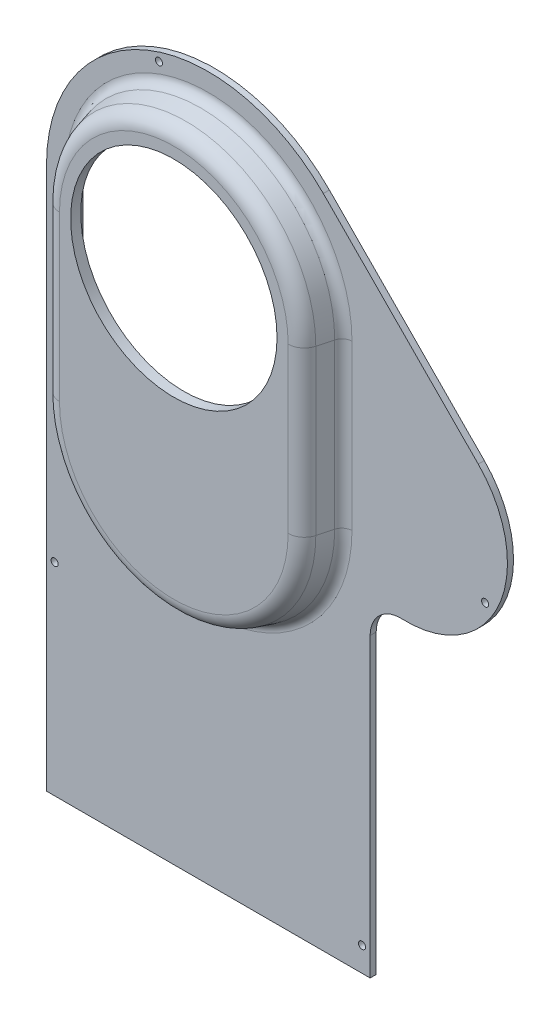
ISO-10303-21;
HEADER;
FILE_DESCRIPTION(('STEP AP214'),'2;1');
FILE_NAME('part.step','',(''),(''),'','','');
FILE_SCHEMA(('AUTOMOTIVE_DESIGN { 1 0 10303 214 1 1 1 1 }'));
ENDSEC;
DATA;
#1=APPLICATION_CONTEXT('core data for automotive mechanical design processes');
#2=APPLICATION_PROTOCOL_DEFINITION('international standard','automotive_design',2000,#1);
#3=PRODUCT_CONTEXT('',#1,'mechanical');
#4=PRODUCT('Part','Part','',(#3));
#5=PRODUCT_RELATED_PRODUCT_CATEGORY('part','',(#4));
#6=PRODUCT_DEFINITION_FORMATION('','',#4);
#7=PRODUCT_DEFINITION_CONTEXT('part definition',#1,'design');
#8=PRODUCT_DEFINITION('design','',#6,#7);
#9=PRODUCT_DEFINITION_SHAPE('','',#8);
#10=(LENGTH_UNIT() NAMED_UNIT(*) SI_UNIT(.MILLI.,.METRE.));
#11=(NAMED_UNIT(*) PLANE_ANGLE_UNIT() SI_UNIT($,.RADIAN.));
#12=(NAMED_UNIT(*) SI_UNIT($,.STERADIAN.) SOLID_ANGLE_UNIT());
#13=UNCERTAINTY_MEASURE_WITH_UNIT(LENGTH_MEASURE(1.E-05),#10,'distance_accuracy_value','');
#14=(GEOMETRIC_REPRESENTATION_CONTEXT(3) GLOBAL_UNCERTAINTY_ASSIGNED_CONTEXT((#13)) GLOBAL_UNIT_ASSIGNED_CONTEXT((#10,
#11,#12)) REPRESENTATION_CONTEXT('',''));
#15=CARTESIAN_POINT('',(0.,0.,0.));
#16=DIRECTION('',(0.,0.,1.));
#17=DIRECTION('',(1.,0.,0.));
#18=AXIS2_PLACEMENT_3D('',#15,#16,#17);
#19=CARTESIAN_POINT('',(10.6567303435174,21.0340968700912,0.));
#20=DIRECTION('',(0.,0.,1.));
#21=DIRECTION('',(1.,0.,0.));
#22=AXIS2_PLACEMENT_3D('',#19,#20,#21);
#23=PLANE('',#22);
#24=CARTESIAN_POINT('',(86.6567303435173,-234.965903129909,0.));
#25=DIRECTION('',(0.,0.,1.));
#26=DIRECTION('',(1.,0.,0.));
#27=AXIS2_PLACEMENT_3D('',#24,#25,#26);
#28=CIRCLE('',#27,1.75);
#29=CARTESIAN_POINT('',(88.4067303435173,-234.965903129909,0.));
#30=VERTEX_POINT('',#29);
#31=EDGE_CURVE('E860',#30,#30,#28,.T.);
#32=ORIENTED_EDGE('',*,*,#31,.T.);
#33=EDGE_LOOP('',(#32));
#34=FACE_BOUND('',#33,.T.);
#35=CARTESIAN_POINT('',(-65.2642696564826,-146.965903129909,0.));
#36=DIRECTION('',(0.,0.,1.));
#37=DIRECTION('',(1.,0.,0.));
#38=AXIS2_PLACEMENT_3D('',#35,#36,#37);
#39=CIRCLE('',#38,1.75);
#40=CARTESIAN_POINT('',(-63.5142696564826,-146.965903129909,0.));
#41=VERTEX_POINT('',#40);
#42=EDGE_CURVE('E854',#41,#41,#39,.T.);
#43=ORIENTED_EDGE('',*,*,#42,.T.);
#44=EDGE_LOOP('',(#43));
#45=FACE_BOUND('',#44,.T.);
#46=CARTESIAN_POINT('',(147.488744141459,-57.965903129909,0.));
#47=DIRECTION('',(0.,0.,1.));
#48=DIRECTION('',(1.,0.,0.));
#49=AXIS2_PLACEMENT_3D('',#46,#47,#48);
#50=CIRCLE('',#49,1.75000000000001);
#51=CARTESIAN_POINT('',(149.238744141459,-57.965903129909,0.));
#52=VERTEX_POINT('',#51);
#53=EDGE_CURVE('E849',#52,#52,#50,.T.);
#54=ORIENTED_EDGE('',*,*,#53,.T.);
#55=EDGE_LOOP('',(#54));
#56=FACE_BOUND('',#55,.T.);
#57=CARTESIAN_POINT('',(-13.6743197776755,93.0340968700912,0.));
#58=DIRECTION('',(0.,0.,1.));
#59=DIRECTION('',(1.,0.,0.));
#60=AXIS2_PLACEMENT_3D('',#57,#58,#59);
#61=CIRCLE('',#60,1.75);
#62=CARTESIAN_POINT('',(-11.9243197776755,93.0340968700912,0.));
#63=VERTEX_POINT('',#62);
#64=EDGE_CURVE('E842',#63,#63,#61,.T.);
#65=ORIENTED_EDGE('',*,*,#64,.T.);
#66=EDGE_LOOP('',(#65));
#67=FACE_BOUND('',#66,.T.);
#68=CARTESIAN_POINT('',(10.6567303435174,21.0340968700912,0.));
#69=DIRECTION('',(0.,0.,1.));
#70=DIRECTION('',(1.,0.,0.));
#71=AXIS2_PLACEMENT_3D('',#68,#69,#70);
#72=CIRCLE('',#71,79.921);
#73=CARTESIAN_POINT('',(67.51781858102,77.1962094144654,0.));
#74=VERTEX_POINT('',#73);
#75=CARTESIAN_POINT('',(-69.2642696564826,21.0340968700912,0.));
#76=VERTEX_POINT('',#75);
#77=EDGE_CURVE('E275',#74,#76,#72,.T.);
#78=ORIENTED_EDGE('',*,*,#77,.F.);
#79=DIRECTION('',(-0.702720343143531,0.711466175817402,0.));
#80=VECTOR('',#79,1.);
#81=CARTESIAN_POINT('',(144.090909762029,-0.329885972732348,0.));
#82=LINE('',#81,#80);
#83=CARTESIAN_POINT('',(144.090909762029,-0.329885972732348,0.));
#84=VERTEX_POINT('',#83);
#85=EDGE_CURVE('E289',#84,#74,#82,.T.);
#86=ORIENTED_EDGE('',*,*,#85,.F.);
#87=CARTESIAN_POINT('',(108.517600971159,-35.4659031299089,0.));
#88=DIRECTION('',(0.,0.,1.));
#89=DIRECTION('',(1.,0.,0.));
#90=AXIS2_PLACEMENT_3D('',#87,#88,#89);
#91=CIRCLE('',#90,50.);
#92=CARTESIAN_POINT('',(106.316931257588,-85.4174501811442,0.));
#93=VERTEX_POINT('',#92);
#94=EDGE_CURVE('E287',#93,#84,#91,.T.);
#95=ORIENTED_EDGE('',*,*,#94,.F.);
#96=CARTESIAN_POINT('',(105.656730343517,-100.402914296515,0.));
#97=DIRECTION('',(0.,0.,-1.));
#98=DIRECTION('',(1.,0.,0.));
#99=AXIS2_PLACEMENT_3D('',#96,#97,#98);
#100=CIRCLE('',#99,15.);
#101=CARTESIAN_POINT('',(90.6567303435173,-100.402914296515,0.));
#102=VERTEX_POINT('',#101);
#103=EDGE_CURVE('E285',#102,#93,#100,.T.);
#104=ORIENTED_EDGE('',*,*,#103,.F.);
#105=DIRECTION('',(0.,1.,0.));
#106=VECTOR('',#105,1.);
#107=CARTESIAN_POINT('',(90.6567303435173,-246.965903129909,0.));
#108=LINE('',#107,#106);
#109=CARTESIAN_POINT('',(90.6567303435173,-246.965903129909,0.));
#110=VERTEX_POINT('',#109);
#111=EDGE_CURVE('E283',#110,#102,#108,.T.);
#112=ORIENTED_EDGE('',*,*,#111,.F.);
#113=DIRECTION('',(1.,0.,0.));
#114=VECTOR('',#113,1.);
#115=CARTESIAN_POINT('',(-69.2642696564826,-246.965903129909,0.));
#116=LINE('',#115,#114);
#117=CARTESIAN_POINT('',(-69.2642696564826,-246.965903129909,0.));
#118=VERTEX_POINT('',#117);
#119=EDGE_CURVE('E281',#118,#110,#116,.T.);
#120=ORIENTED_EDGE('',*,*,#119,.F.);
#121=DIRECTION('',(0.,-1.,0.));
#122=VECTOR('',#121,1.);
#123=CARTESIAN_POINT('',(-69.2642696564826,21.0340968700912,0.));
#124=LINE('',#123,#122);
#125=EDGE_CURVE('E278',#76,#118,#124,.T.);
#126=ORIENTED_EDGE('',*,*,#125,.F.);
#127=EDGE_LOOP('',(#78,#86,#95,#104,#112,#120,#126));
#128=FACE_BOUND('',#127,.T.);
#129=DIRECTION('',(0.,1.,0.));
#130=VECTOR('',#129,1.);
#131=CARTESIAN_POINT('',(-54.3760570190842,21.0340968700912,0.));
#132=LINE('',#131,#130);
#133=CARTESIAN_POINT('',(-54.3760570190842,-59.9659031299088,0.));
#134=VERTEX_POINT('',#133);
#135=CARTESIAN_POINT('',(-54.3760570190842,21.0340968700912,0.));
#136=VERTEX_POINT('',#135);
#137=EDGE_CURVE('E271',#134,#136,#132,.T.);
#138=ORIENTED_EDGE('',*,*,#137,.F.);
#139=CARTESIAN_POINT('',(10.6567303435173,-59.9659031299088,0.));
#140=DIRECTION('',(0.,0.,-1.));
#141=DIRECTION('',(-1.,0.,0.));
#142=AXIS2_PLACEMENT_3D('',#139,#140,#141);
#143=CIRCLE('',#142,65.0327873626014);
#144=CARTESIAN_POINT('',(75.6895177061187,-59.9659031299088,0.));
#145=VERTEX_POINT('',#144);
#146=EDGE_CURVE('E269',#145,#134,#143,.T.);
#147=ORIENTED_EDGE('',*,*,#146,.F.);
#148=DIRECTION('',(0.,-1.,0.));
#149=VECTOR('',#148,1.);
#150=CARTESIAN_POINT('',(75.6895177061187,21.0340968700912,0.));
#151=LINE('',#150,#149);
#152=CARTESIAN_POINT('',(75.6895177061187,21.0340968700912,0.));
#153=VERTEX_POINT('',#152);
#154=EDGE_CURVE('E247',#153,#145,#151,.T.);
#155=ORIENTED_EDGE('',*,*,#154,.F.);
#156=CARTESIAN_POINT('',(10.6567303435173,21.0340968700912,0.));
#157=DIRECTION('',(0.,0.,-1.));
#158=DIRECTION('',(-1.,0.,0.));
#159=AXIS2_PLACEMENT_3D('',#156,#157,#158);
#160=CIRCLE('',#159,65.0327873626014);
#161=EDGE_CURVE('E198',#136,#153,#160,.T.);
#162=ORIENTED_EDGE('',*,*,#161,.F.);
#163=EDGE_LOOP('',(#138,#147,#155,#162));
#164=FACE_BOUND('',#163,.T.);
#165=ADVANCED_FACE('F34',(#34,#45,#56,#67,#128,#164),#23,.F.);
#166=CARTESIAN_POINT('',(10.6567303435174,21.0340968700912,3.));
#167=DIRECTION('',(0.,0.,1.));
#168=DIRECTION('',(1.,0.,0.));
#169=AXIS2_PLACEMENT_3D('',#166,#167,#168);
#170=PLANE('',#169);
#171=CARTESIAN_POINT('',(86.6567303435173,-234.965903129909,3.));
#172=DIRECTION('',(0.,0.,1.));
#173=DIRECTION('',(1.,0.,0.));
#174=AXIS2_PLACEMENT_3D('',#171,#172,#173);
#175=CIRCLE('',#174,1.75);
#176=CARTESIAN_POINT('',(88.4067303435173,-234.965903129909,3.));
#177=VERTEX_POINT('',#176);
#178=EDGE_CURVE('E863',#177,#177,#175,.T.);
#179=ORIENTED_EDGE('',*,*,#178,.F.);
#180=EDGE_LOOP('',(#179));
#181=FACE_BOUND('',#180,.T.);
#182=CARTESIAN_POINT('',(-65.2642696564826,-146.965903129909,3.));
#183=DIRECTION('',(0.,0.,1.));
#184=DIRECTION('',(1.,0.,0.));
#185=AXIS2_PLACEMENT_3D('',#182,#183,#184);
#186=CIRCLE('',#185,1.75);
#187=CARTESIAN_POINT('',(-63.5142696564826,-146.965903129909,3.));
#188=VERTEX_POINT('',#187);
#189=EDGE_CURVE('E857',#188,#188,#186,.T.);
#190=ORIENTED_EDGE('',*,*,#189,.F.);
#191=EDGE_LOOP('',(#190));
#192=FACE_BOUND('',#191,.T.);
#193=CARTESIAN_POINT('',(147.488744141459,-57.965903129909,3.));
#194=DIRECTION('',(0.,0.,1.));
#195=DIRECTION('',(1.,0.,0.));
#196=AXIS2_PLACEMENT_3D('',#193,#194,#195);
#197=CIRCLE('',#196,1.75000000000001);
#198=CARTESIAN_POINT('',(149.238744141459,-57.965903129909,3.));
#199=VERTEX_POINT('',#198);
#200=EDGE_CURVE('E851',#199,#199,#197,.T.);
#201=ORIENTED_EDGE('',*,*,#200,.F.);
#202=EDGE_LOOP('',(#201));
#203=FACE_BOUND('',#202,.T.);
#204=CARTESIAN_POINT('',(-13.6743197776755,93.0340968700912,3.));
#205=DIRECTION('',(0.,0.,1.));
#206=DIRECTION('',(1.,0.,0.));
#207=AXIS2_PLACEMENT_3D('',#204,#205,#206);
#208=CIRCLE('',#207,1.75);
#209=CARTESIAN_POINT('',(-11.9243197776755,93.0340968700912,3.));
#210=VERTEX_POINT('',#209);
#211=EDGE_CURVE('E845',#210,#210,#208,.T.);
#212=ORIENTED_EDGE('',*,*,#211,.F.);
#213=EDGE_LOOP('',(#212));
#214=FACE_BOUND('',#213,.T.);
#215=DIRECTION('',(0.,-1.,0.));
#216=VECTOR('',#215,1.);
#217=CARTESIAN_POINT('',(81.6895177061187,21.0340968700912,3.));
#218=LINE('',#217,#216);
#219=CARTESIAN_POINT('',(81.6895177061187,21.0340968700912,3.));
#220=VERTEX_POINT('',#219);
#221=CARTESIAN_POINT('',(81.6895177061187,-59.9659031299088,3.));
#222=VERTEX_POINT('',#221);
#223=EDGE_CURVE('E342',#220,#222,#218,.T.);
#224=ORIENTED_EDGE('',*,*,#223,.T.);
#225=CARTESIAN_POINT('',(10.6567303435173,-59.9659031299088,3.));
#226=DIRECTION('',(0.,0.,1.));
#227=DIRECTION('',(1.,0.,0.));
#228=AXIS2_PLACEMENT_3D('',#225,#226,#227);
#229=CIRCLE('',#228,71.0327873626015);
#230=CARTESIAN_POINT('',(-60.3760570190841,-59.9659031299088,3.));
#231=VERTEX_POINT('',#230);
#232=EDGE_CURVE('E344',#222,#231,#229,.F.);
#233=ORIENTED_EDGE('',*,*,#232,.T.);
#234=DIRECTION('',(0.,1.,0.));
#235=VECTOR('',#234,1.);
#236=CARTESIAN_POINT('',(-60.3760570190842,21.0340968700912,3.));
#237=LINE('',#236,#235);
#238=CARTESIAN_POINT('',(-60.3760570190842,21.0340968700912,3.));
#239=VERTEX_POINT('',#238);
#240=EDGE_CURVE('E340',#231,#239,#237,.T.);
#241=ORIENTED_EDGE('',*,*,#240,.T.);
#242=CARTESIAN_POINT('',(10.6567303435173,21.0340968700912,3.));
#243=DIRECTION('',(0.,0.,1.));
#244=DIRECTION('',(1.,0.,0.));
#245=AXIS2_PLACEMENT_3D('',#242,#243,#244);
#246=CIRCLE('',#245,71.0327873626014);
#247=EDGE_CURVE('E338',#239,#220,#246,.F.);
#248=ORIENTED_EDGE('',*,*,#247,.T.);
#249=EDGE_LOOP('',(#224,#233,#241,#248));
#250=FACE_BOUND('',#249,.T.);
#251=CARTESIAN_POINT('',(10.6567303435174,21.0340968700912,3.));
#252=DIRECTION('',(0.,0.,1.));
#253=DIRECTION('',(1.,0.,0.));
#254=AXIS2_PLACEMENT_3D('',#251,#252,#253);
#255=CIRCLE('',#254,79.921);
#256=CARTESIAN_POINT('',(67.51781858102,77.1962094144654,3.));
#257=VERTEX_POINT('',#256);
#258=CARTESIAN_POINT('',(-69.2642696564826,21.0340968700912,3.));
#259=VERTEX_POINT('',#258);
#260=EDGE_CURVE('E291',#257,#259,#255,.T.);
#261=ORIENTED_EDGE('',*,*,#260,.T.);
#262=DIRECTION('',(0.,-1.,0.));
#263=VECTOR('',#262,1.);
#264=CARTESIAN_POINT('',(-69.2642696564826,21.0340968700912,3.));
#265=LINE('',#264,#263);
#266=CARTESIAN_POINT('',(-69.2642696564826,-246.965903129909,3.));
#267=VERTEX_POINT('',#266);
#268=EDGE_CURVE('E294',#259,#267,#265,.T.);
#269=ORIENTED_EDGE('',*,*,#268,.T.);
#270=DIRECTION('',(1.,0.,0.));
#271=VECTOR('',#270,1.);
#272=CARTESIAN_POINT('',(-69.2642696564826,-246.965903129909,3.));
#273=LINE('',#272,#271);
#274=CARTESIAN_POINT('',(90.6567303435173,-246.965903129909,3.));
#275=VERTEX_POINT('',#274);
#276=EDGE_CURVE('E296',#267,#275,#273,.T.);
#277=ORIENTED_EDGE('',*,*,#276,.T.);
#278=DIRECTION('',(0.,1.,0.));
#279=VECTOR('',#278,1.);
#280=CARTESIAN_POINT('',(90.6567303435173,-246.965903129909,3.));
#281=LINE('',#280,#279);
#282=CARTESIAN_POINT('',(90.6567303435173,-100.402914296515,3.));
#283=VERTEX_POINT('',#282);
#284=EDGE_CURVE('E298',#275,#283,#281,.T.);
#285=ORIENTED_EDGE('',*,*,#284,.T.);
#286=CARTESIAN_POINT('',(105.656730343517,-100.402914296515,3.));
#287=DIRECTION('',(0.,0.,-1.));
#288=DIRECTION('',(1.,0.,0.));
#289=AXIS2_PLACEMENT_3D('',#286,#287,#288);
#290=CIRCLE('',#289,15.);
#291=CARTESIAN_POINT('',(106.316931257588,-85.4174501811442,3.));
#292=VERTEX_POINT('',#291);
#293=EDGE_CURVE('E300',#283,#292,#290,.T.);
#294=ORIENTED_EDGE('',*,*,#293,.T.);
#295=CARTESIAN_POINT('',(108.517600971159,-35.4659031299089,3.));
#296=DIRECTION('',(0.,0.,1.));
#297=DIRECTION('',(1.,0.,0.));
#298=AXIS2_PLACEMENT_3D('',#295,#296,#297);
#299=CIRCLE('',#298,50.);
#300=CARTESIAN_POINT('',(144.090909762029,-0.329885972732348,3.));
#301=VERTEX_POINT('',#300);
#302=EDGE_CURVE('E302',#292,#301,#299,.T.);
#303=ORIENTED_EDGE('',*,*,#302,.T.);
#304=DIRECTION('',(-0.702720343143531,0.711466175817402,0.));
#305=VECTOR('',#304,1.);
#306=CARTESIAN_POINT('',(144.090909762029,-0.329885972732348,3.));
#307=LINE('',#306,#305);
#308=EDGE_CURVE('E304',#301,#257,#307,.T.);
#309=ORIENTED_EDGE('',*,*,#308,.T.);
#310=EDGE_LOOP('',(#261,#269,#277,#285,#294,#303,#309));
#311=FACE_BOUND('',#310,.T.);
#312=ADVANCED_FACE('F447',(#181,#192,#203,#214,#250,#311),#170,.T.);
#313=CARTESIAN_POINT('',(10.6567303435174,21.0340968700912,3.));
#314=DIRECTION('',(0.,0.,-1.));
#315=DIRECTION('',(-1.,0.,0.));
#316=AXIS2_PLACEMENT_3D('',#313,#314,#315);
#317=CYLINDRICAL_SURFACE('',#316,79.921);
#318=ORIENTED_EDGE('',*,*,#77,.T.);
#319=DIRECTION('',(0.,0.,-1.));
#320=VECTOR('',#319,1.);
#321=CARTESIAN_POINT('',(-69.2642696564826,21.0340968700912,3.));
#322=LINE('',#321,#320);
#323=EDGE_CURVE('E324',#259,#76,#322,.T.);
#324=ORIENTED_EDGE('',*,*,#323,.F.);
#325=ORIENTED_EDGE('',*,*,#260,.F.);
#326=DIRECTION('',(0.,0.,-1.));
#327=VECTOR('',#326,1.);
#328=CARTESIAN_POINT('',(67.51781858102,77.1962094144654,3.));
#329=LINE('',#328,#327);
#330=EDGE_CURVE('E306',#257,#74,#329,.T.);
#331=ORIENTED_EDGE('',*,*,#330,.T.);
#332=EDGE_LOOP('',(#318,#324,#325,#331));
#333=FACE_BOUND('',#332,.T.);
#334=ADVANCED_FACE('F452',(#333),#317,.T.);
#335=CARTESIAN_POINT('',(-69.2642696564826,21.0340968700912,3.));
#336=DIRECTION('',(1.,0.,0.));
#337=DIRECTION('',(0.,1.,0.));
#338=AXIS2_PLACEMENT_3D('',#335,#336,#337);
#339=PLANE('',#338);
#340=ORIENTED_EDGE('',*,*,#125,.T.);
#341=DIRECTION('',(0.,0.,-1.));
#342=VECTOR('',#341,1.);
#343=CARTESIAN_POINT('',(-69.2642696564826,-246.965903129909,3.));
#344=LINE('',#343,#342);
#345=EDGE_CURVE('E321',#267,#118,#344,.T.);
#346=ORIENTED_EDGE('',*,*,#345,.F.);
#347=ORIENTED_EDGE('',*,*,#268,.F.);
#348=ORIENTED_EDGE('',*,*,#323,.T.);
#349=EDGE_LOOP('',(#340,#346,#347,#348));
#350=FACE_BOUND('',#349,.T.);
#351=ADVANCED_FACE('F477',(#350),#339,.F.);
#352=CARTESIAN_POINT('',(-69.2642696564826,-246.965903129909,3.));
#353=DIRECTION('',(0.,1.,0.));
#354=DIRECTION('',(0.,0.,1.));
#355=AXIS2_PLACEMENT_3D('',#352,#353,#354);
#356=PLANE('',#355);
#357=ORIENTED_EDGE('',*,*,#119,.T.);
#358=DIRECTION('',(0.,0.,-1.));
#359=VECTOR('',#358,1.);
#360=CARTESIAN_POINT('',(90.6567303435173,-246.965903129909,3.));
#361=LINE('',#360,#359);
#362=EDGE_CURVE('E318',#275,#110,#361,.T.);
#363=ORIENTED_EDGE('',*,*,#362,.F.);
#364=ORIENTED_EDGE('',*,*,#276,.F.);
#365=ORIENTED_EDGE('',*,*,#345,.T.);
#366=EDGE_LOOP('',(#357,#363,#364,#365));
#367=FACE_BOUND('',#366,.T.);
#368=ADVANCED_FACE('F473',(#367),#356,.F.);
#369=CARTESIAN_POINT('',(90.6567303435173,-246.965903129909,3.));
#370=DIRECTION('',(-1.,0.,0.));
#371=DIRECTION('',(0.,0.,1.));
#372=AXIS2_PLACEMENT_3D('',#369,#370,#371);
#373=PLANE('',#372);
#374=ORIENTED_EDGE('',*,*,#111,.T.);
#375=DIRECTION('',(0.,0.,-1.));
#376=VECTOR('',#375,1.);
#377=CARTESIAN_POINT('',(90.6567303435173,-100.402914296515,3.));
#378=LINE('',#377,#376);
#379=EDGE_CURVE('E315',#283,#102,#378,.T.);
#380=ORIENTED_EDGE('',*,*,#379,.F.);
#381=ORIENTED_EDGE('',*,*,#284,.F.);
#382=ORIENTED_EDGE('',*,*,#362,.T.);
#383=EDGE_LOOP('',(#374,#380,#381,#382));
#384=FACE_BOUND('',#383,.T.);
#385=ADVANCED_FACE('F469',(#384),#373,.F.);
#386=CARTESIAN_POINT('',(105.656730343517,-100.402914296515,3.));
#387=DIRECTION('',(0.,0.,-1.));
#388=DIRECTION('',(-1.,0.,0.));
#389=AXIS2_PLACEMENT_3D('',#386,#387,#388);
#390=CYLINDRICAL_SURFACE('',#389,15.);
#391=ORIENTED_EDGE('',*,*,#103,.T.);
#392=DIRECTION('',(0.,0.,-1.));
#393=VECTOR('',#392,1.);
#394=CARTESIAN_POINT('',(106.316931257588,-85.4174501811442,3.));
#395=LINE('',#394,#393);
#396=EDGE_CURVE('E312',#292,#93,#395,.T.);
#397=ORIENTED_EDGE('',*,*,#396,.F.);
#398=ORIENTED_EDGE('',*,*,#293,.F.);
#399=ORIENTED_EDGE('',*,*,#379,.T.);
#400=EDGE_LOOP('',(#391,#397,#398,#399));
#401=FACE_BOUND('',#400,.T.);
#402=ADVANCED_FACE('F465',(#401),#390,.F.);
#403=CARTESIAN_POINT('',(108.517600971159,-35.4659031299089,3.));
#404=DIRECTION('',(0.,0.,-1.));
#405=DIRECTION('',(-1.,0.,0.));
#406=AXIS2_PLACEMENT_3D('',#403,#404,#405);
#407=CYLINDRICAL_SURFACE('',#406,50.);
#408=ORIENTED_EDGE('',*,*,#94,.T.);
#409=DIRECTION('',(0.,0.,-1.));
#410=VECTOR('',#409,1.);
#411=CARTESIAN_POINT('',(144.090909762029,-0.329885972732348,3.));
#412=LINE('',#411,#410);
#413=EDGE_CURVE('E309',#301,#84,#412,.T.);
#414=ORIENTED_EDGE('',*,*,#413,.F.);
#415=ORIENTED_EDGE('',*,*,#302,.F.);
#416=ORIENTED_EDGE('',*,*,#396,.T.);
#417=EDGE_LOOP('',(#408,#414,#415,#416));
#418=FACE_BOUND('',#417,.T.);
#419=ADVANCED_FACE('F461',(#418),#407,.T.);
#420=CARTESIAN_POINT('',(144.090909762029,-0.329885972732348,3.));
#421=DIRECTION('',(-0.711466175817402,-0.702720343143531,0.));
#422=DIRECTION('',(0.702720343143531,-0.711466175817402,0.));
#423=AXIS2_PLACEMENT_3D('',#420,#421,#422);
#424=PLANE('',#423);
#425=ORIENTED_EDGE('',*,*,#85,.T.);
#426=ORIENTED_EDGE('',*,*,#330,.F.);
#427=ORIENTED_EDGE('',*,*,#308,.F.);
#428=ORIENTED_EDGE('',*,*,#413,.T.);
#429=EDGE_LOOP('',(#425,#426,#427,#428));
#430=FACE_BOUND('',#429,.T.);
#431=ADVANCED_FACE('F458',(#430),#424,.F.);
#432=CARTESIAN_POINT('',(10.6567303435173,-59.9659031299088,0.));
#433=DIRECTION('',(0.,0.,-1.));
#434=DIRECTION('',(1.,0.,0.));
#435=AXIS2_PLACEMENT_3D('',#432,#433,#434);
#436=CONICAL_SURFACE('',#435,68.,0.26179938779915);
#437=DIRECTION('',(0.258819045102521,0.,-0.965925826289068));
#438=VECTOR('',#437,1.);
#439=CARTESIAN_POINT('',(78.6567303435173,-59.9659031299088,0.));
#440=LINE('',#439,#438);
#441=CARTESIAN_POINT('',(74.8865372013757,-59.9659031299088,14.0705523608202));
#442=VERTEX_POINT('',#441);
#443=CARTESIAN_POINT('',(76.8598885746734,-59.9659031299088,6.70590477448739));
#444=VERTEX_POINT('',#443);
#445=EDGE_CURVE('E279',#442,#444,#440,.T.);
#446=ORIENTED_EDGE('',*,*,#445,.F.);
#447=CARTESIAN_POINT('',(10.6567303435173,-59.9659031299088,14.0705523608202));
#448=DIRECTION('',(0.,0.,-1.));
#449=DIRECTION('',(-1.,0.,0.));
#450=AXIS2_PLACEMENT_3D('',#447,#448,#449);
#451=CIRCLE('',#450,64.2298068578584);
#452=CARTESIAN_POINT('',(-53.5730765143411,-59.9659031299088,14.0705523608202));
#453=VERTEX_POINT('',#452);
#454=EDGE_CURVE('E43',#442,#453,#451,.T.);
#455=ORIENTED_EDGE('',*,*,#454,.T.);
#456=DIRECTION('',(-0.258819045102521,0.,-0.965925826289068));
#457=VECTOR('',#456,1.);
#458=CARTESIAN_POINT('',(-57.3432696564827,-59.9659031299088,0.));
#459=LINE('',#458,#457);
#460=CARTESIAN_POINT('',(-55.5464278876388,-59.9659031299088,6.7059047744874));
#461=VERTEX_POINT('',#460);
#462=EDGE_CURVE('E328',#453,#461,#459,.T.);
#463=ORIENTED_EDGE('',*,*,#462,.T.);
#464=CARTESIAN_POINT('',(10.6567303435173,-59.9659031299088,6.70590477448746));
#465=DIRECTION('',(0.,0.,1.));
#466=DIRECTION('',(1.,0.,0.));
#467=AXIS2_PLACEMENT_3D('',#464,#465,#466);
#468=CIRCLE('',#467,66.2031582311561);
#469=EDGE_CURVE('E327',#461,#444,#468,.T.);
#470=ORIENTED_EDGE('',*,*,#469,.T.);
#471=EDGE_LOOP('',(#446,#455,#463,#470));
#472=FACE_BOUND('',#471,.T.);
#473=ADVANCED_FACE('F421',(#472),#436,.T.);
#474=CARTESIAN_POINT('',(78.6567303435172,21.0340968700912,0.));
#475=DIRECTION('',(0.965925826289068,0.,0.258819045102521));
#476=DIRECTION('',(0.258819045102521,0.,-0.965925826289068));
#477=AXIS2_PLACEMENT_3D('',#474,#475,#476);
#478=PLANE('',#477);
#479=DIRECTION('',(0.258819045102521,0.,-0.965925826289068));
#480=VECTOR('',#479,1.);
#481=CARTESIAN_POINT('',(78.6567303435173,21.0340968700912,0.));
#482=LINE('',#481,#480);
#483=CARTESIAN_POINT('',(74.8865372013757,21.0340968700912,14.0705523608202));
#484=VERTEX_POINT('',#483);
#485=CARTESIAN_POINT('',(76.8598885746733,21.0340968700912,6.70590477448739));
#486=VERTEX_POINT('',#485);
#487=EDGE_CURVE('E333',#484,#486,#482,.T.);
#488=ORIENTED_EDGE('',*,*,#487,.F.);
#489=DIRECTION('',(0.,1.,0.));
#490=VECTOR('',#489,1.);
#491=CARTESIAN_POINT('',(74.8865372013757,-59.9659031299088,14.0705523608202));
#492=LINE('',#491,#490);
#493=EDGE_CURVE('E376',#484,#442,#492,.F.);
#494=ORIENTED_EDGE('',*,*,#493,.T.);
#495=ORIENTED_EDGE('',*,*,#445,.T.);
#496=DIRECTION('',(0.,1.,0.));
#497=VECTOR('',#496,1.);
#498=CARTESIAN_POINT('',(76.8598885746733,21.0340968700912,6.70590477448739));
#499=LINE('',#498,#497);
#500=EDGE_CURVE('E347',#444,#486,#499,.T.);
#501=ORIENTED_EDGE('',*,*,#500,.T.);
#502=EDGE_LOOP('',(#488,#494,#495,#501));
#503=FACE_BOUND('',#502,.T.);
#504=ADVANCED_FACE('F423',(#503),#478,.T.);
#505=CARTESIAN_POINT('',(10.6567303435173,21.0340968700912,0.));
#506=DIRECTION('',(0.,0.,-1.));
#507=DIRECTION('',(1.,0.,0.));
#508=AXIS2_PLACEMENT_3D('',#505,#506,#507);
#509=CONICAL_SURFACE('',#508,68.,0.26179938779915);
#510=DIRECTION('',(-0.258819045102521,0.,-0.965925826289068));
#511=VECTOR('',#510,1.);
#512=CARTESIAN_POINT('',(-57.3432696564827,21.0340968700912,0.));
#513=LINE('',#512,#511);
#514=CARTESIAN_POINT('',(-53.5730765143411,21.0340968700912,14.0705523608202));
#515=VERTEX_POINT('',#514);
#516=CARTESIAN_POINT('',(-55.5464278876388,21.0340968700912,6.70590477448739));
#517=VERTEX_POINT('',#516);
#518=EDGE_CURVE('E330',#515,#517,#513,.T.);
#519=ORIENTED_EDGE('',*,*,#518,.F.);
#520=CARTESIAN_POINT('',(10.6567303435173,21.0340968700912,14.0705523608202));
#521=DIRECTION('',(0.,0.,-1.));
#522=DIRECTION('',(-1.,0.,0.));
#523=AXIS2_PLACEMENT_3D('',#520,#521,#522);
#524=CIRCLE('',#523,64.2298068578584);
#525=EDGE_CURVE('E379',#515,#484,#524,.T.);
#526=ORIENTED_EDGE('',*,*,#525,.T.);
#527=ORIENTED_EDGE('',*,*,#487,.T.);
#528=CARTESIAN_POINT('',(10.6567303435173,21.0340968700912,6.70590477448743));
#529=DIRECTION('',(0.,0.,1.));
#530=DIRECTION('',(1.,0.,0.));
#531=AXIS2_PLACEMENT_3D('',#528,#529,#530);
#532=CIRCLE('',#531,66.2031582311561);
#533=EDGE_CURVE('E353',#486,#517,#532,.T.);
#534=ORIENTED_EDGE('',*,*,#533,.T.);
#535=EDGE_LOOP('',(#519,#526,#527,#534));
#536=FACE_BOUND('',#535,.T.);
#537=ADVANCED_FACE('F402',(#536),#509,.T.);
#538=CARTESIAN_POINT('',(-57.3432696564827,21.0340968700912,0.));
#539=DIRECTION('',(-0.965925826289068,0.,0.258819045102521));
#540=DIRECTION('',(0.258819045102521,0.,0.965925826289068));
#541=AXIS2_PLACEMENT_3D('',#538,#539,#540);
#542=PLANE('',#541);
#543=ORIENTED_EDGE('',*,*,#462,.F.);
#544=DIRECTION('',(0.,-1.,0.));
#545=VECTOR('',#544,1.);
#546=CARTESIAN_POINT('',(-53.5730765143411,21.0340968700912,14.0705523608202));
#547=LINE('',#546,#545);
#548=EDGE_CURVE('E11',#453,#515,#547,.F.);
#549=ORIENTED_EDGE('',*,*,#548,.T.);
#550=ORIENTED_EDGE('',*,*,#518,.T.);
#551=DIRECTION('',(0.,-1.,0.));
#552=VECTOR('',#551,1.);
#553=CARTESIAN_POINT('',(-55.5464278876388,21.0340968700912,6.70590477448739));
#554=LINE('',#553,#552);
#555=EDGE_CURVE('E350',#517,#461,#554,.T.);
#556=ORIENTED_EDGE('',*,*,#555,.T.);
#557=EDGE_LOOP('',(#543,#549,#550,#556));
#558=FACE_BOUND('',#557,.T.);
#559=ADVANCED_FACE('F400',(#558),#542,.T.);
#560=CARTESIAN_POINT('',(10.6567303435173,-59.9659031299088,20.));
#561=DIRECTION('',(0.,0.,1.));
#562=DIRECTION('',(1.,0.,0.));
#563=AXIS2_PLACEMENT_3D('',#560,#561,#562);
#564=PLANE('',#563);
#565=CARTESIAN_POINT('',(10.6567303435173,21.0340968700912,20.));
#566=DIRECTION('',(0.,0.,1.));
#567=DIRECTION('',(1.,0.,0.));
#568=AXIS2_PLACEMENT_3D('',#565,#566,#567);
#569=CIRCLE('',#568,51.);
#570=CARTESIAN_POINT('',(61.6567303435172,21.0340968700912,20.));
#571=VERTEX_POINT('',#570);
#572=EDGE_CURVE('E840',#571,#571,#569,.T.);
#573=ORIENTED_EDGE('',*,*,#572,.F.);
#574=EDGE_LOOP('',(#573));
#575=FACE_BOUND('',#574,.T.);
#576=CARTESIAN_POINT('',(10.6567303435173,-59.9659031299088,20.));
#577=DIRECTION('',(0.,0.,1.));
#578=DIRECTION('',(1.,0.,0.));
#579=AXIS2_PLACEMENT_3D('',#576,#577,#578);
#580=CIRCLE('',#579,56.5024002475459);
#581=CARTESIAN_POINT('',(-45.8456699040286,-59.9659031299088,20.));
#582=VERTEX_POINT('',#581);
#583=CARTESIAN_POINT('',(67.1591305910631,-59.9659031299088,20.));
#584=VERTEX_POINT('',#583);
#585=EDGE_CURVE('E369',#582,#584,#580,.T.);
#586=ORIENTED_EDGE('',*,*,#585,.T.);
#587=DIRECTION('',(0.,-1.,0.));
#588=VECTOR('',#587,1.);
#589=CARTESIAN_POINT('',(67.1591305910631,21.0340968700912,20.));
#590=LINE('',#589,#588);
#591=CARTESIAN_POINT('',(67.1591305910631,21.0340968700912,20.));
#592=VERTEX_POINT('',#591);
#593=EDGE_CURVE('E373',#584,#592,#590,.F.);
#594=ORIENTED_EDGE('',*,*,#593,.T.);
#595=CARTESIAN_POINT('',(10.6567303435173,21.0340968700912,20.));
#596=DIRECTION('',(0.,0.,1.));
#597=DIRECTION('',(1.,0.,0.));
#598=AXIS2_PLACEMENT_3D('',#595,#596,#597);
#599=CIRCLE('',#598,56.5024002475458);
#600=CARTESIAN_POINT('',(-45.8456699040286,21.0340968700912,20.));
#601=VERTEX_POINT('',#600);
#602=EDGE_CURVE('E371',#592,#601,#599,.T.);
#603=ORIENTED_EDGE('',*,*,#602,.T.);
#604=DIRECTION('',(0.,1.,0.));
#605=VECTOR('',#604,1.);
#606=CARTESIAN_POINT('',(-45.8456699040286,-59.9659031299088,20.));
#607=LINE('',#606,#605);
#608=EDGE_CURVE('E356',#601,#582,#607,.F.);
#609=ORIENTED_EDGE('',*,*,#608,.T.);
#610=EDGE_LOOP('',(#586,#594,#603,#609));
#611=FACE_BOUND('',#610,.T.);
#612=ADVANCED_FACE('F433',(#575,#611),#564,.T.);
#613=CARTESIAN_POINT('',(10.6567303435173,21.0340968700912,8.));
#614=DIRECTION('',(0.,0.,1.));
#615=DIRECTION('',(1.,0.,0.));
#616=AXIS2_PLACEMENT_3D('',#613,#614,#615);
#617=TOROIDAL_SURFACE('',#616,71.0327873626014,5.);
#618=CARTESIAN_POINT('',(81.6895177061187,21.0340968700912,8.));
#619=DIRECTION('',(0.,1.,0.));
#620=DIRECTION('',(-1.,0.,0.));
#621=AXIS2_PLACEMENT_3D('',#618,#619,#620);
#622=CIRCLE('',#621,5.);
#623=EDGE_CURVE('E363',#220,#486,#622,.T.);
#624=ORIENTED_EDGE('',*,*,#623,.F.);
#625=ORIENTED_EDGE('',*,*,#247,.F.);
#626=CARTESIAN_POINT('',(-60.3760570190842,21.0340968700912,8.));
#627=DIRECTION('',(0.,1.,0.));
#628=DIRECTION('',(0.,0.,1.));
#629=AXIS2_PLACEMENT_3D('',#626,#627,#628);
#630=CIRCLE('',#629,5.);
#631=EDGE_CURVE('E331',#517,#239,#630,.T.);
#632=ORIENTED_EDGE('',*,*,#631,.F.);
#633=ORIENTED_EDGE('',*,*,#533,.F.);
#634=EDGE_LOOP('',(#624,#625,#632,#633));
#635=FACE_BOUND('',#634,.T.);
#636=ADVANCED_FACE('F410',(#635),#617,.F.);
#637=CARTESIAN_POINT('',(-60.3760570190842,21.0340968700912,8.));
#638=DIRECTION('',(0.,1.,0.));
#639=DIRECTION('',(-1.,0.,0.));
#640=AXIS2_PLACEMENT_3D('',#637,#638,#639);
#641=CYLINDRICAL_SURFACE('',#640,5.);
#642=ORIENTED_EDGE('',*,*,#631,.T.);
#643=ORIENTED_EDGE('',*,*,#240,.F.);
#644=CARTESIAN_POINT('',(-60.3760570190841,-59.9659031299088,8.));
#645=DIRECTION('',(0.,1.,0.));
#646=DIRECTION('',(0.,0.,1.));
#647=AXIS2_PLACEMENT_3D('',#644,#645,#646);
#648=CIRCLE('',#647,5.);
#649=EDGE_CURVE('E360',#461,#231,#648,.T.);
#650=ORIENTED_EDGE('',*,*,#649,.F.);
#651=ORIENTED_EDGE('',*,*,#555,.F.);
#652=EDGE_LOOP('',(#642,#643,#650,#651));
#653=FACE_BOUND('',#652,.T.);
#654=ADVANCED_FACE('F414',(#653),#641,.F.);
#655=CARTESIAN_POINT('',(81.6895177061187,21.0340968700912,8.));
#656=DIRECTION('',(0.,-1.,0.));
#657=DIRECTION('',(1.,0.,0.));
#658=AXIS2_PLACEMENT_3D('',#655,#656,#657);
#659=CYLINDRICAL_SURFACE('',#658,5.);
#660=ORIENTED_EDGE('',*,*,#623,.T.);
#661=ORIENTED_EDGE('',*,*,#500,.F.);
#662=CARTESIAN_POINT('',(81.6895177061187,-59.9659031299088,8.));
#663=DIRECTION('',(0.,1.,0.));
#664=DIRECTION('',(0.,0.,1.));
#665=AXIS2_PLACEMENT_3D('',#662,#663,#664);
#666=CIRCLE('',#665,5.);
#667=EDGE_CURVE('E357',#222,#444,#666,.T.);
#668=ORIENTED_EDGE('',*,*,#667,.F.);
#669=ORIENTED_EDGE('',*,*,#223,.F.);
#670=EDGE_LOOP('',(#660,#661,#668,#669));
#671=FACE_BOUND('',#670,.T.);
#672=ADVANCED_FACE('F493',(#671),#659,.F.);
#673=CARTESIAN_POINT('',(10.6567303435173,-59.9659031299088,8.));
#674=DIRECTION('',(0.,0.,1.));
#675=DIRECTION('',(1.,0.,0.));
#676=AXIS2_PLACEMENT_3D('',#673,#674,#675);
#677=TOROIDAL_SURFACE('',#676,71.0327873626015,5.);
#678=ORIENTED_EDGE('',*,*,#649,.T.);
#679=ORIENTED_EDGE('',*,*,#232,.F.);
#680=ORIENTED_EDGE('',*,*,#667,.T.);
#681=ORIENTED_EDGE('',*,*,#469,.F.);
#682=EDGE_LOOP('',(#678,#679,#680,#681));
#683=FACE_BOUND('',#682,.T.);
#684=ADVANCED_FACE('F418',(#683),#677,.F.);
#685=CARTESIAN_POINT('',(-45.8456699040286,-59.9659031299088,12.));
#686=DIRECTION('',(0.,-1.,0.));
#687=DIRECTION('',(1.,0.,0.));
#688=AXIS2_PLACEMENT_3D('',#685,#686,#687);
#689=CYLINDRICAL_SURFACE('',#688,8.);
#690=CARTESIAN_POINT('',(-45.8456699040286,21.0340968700912,12.));
#691=DIRECTION('',(0.,1.,0.));
#692=DIRECTION('',(0.,0.,1.));
#693=AXIS2_PLACEMENT_3D('',#690,#691,#692);
#694=CIRCLE('',#693,8.);
#695=EDGE_CURVE('E385',#515,#601,#694,.T.);
#696=ORIENTED_EDGE('',*,*,#695,.F.);
#697=ORIENTED_EDGE('',*,*,#548,.F.);
#698=CARTESIAN_POINT('',(-45.8456699040286,-59.9659031299088,12.));
#699=DIRECTION('',(0.,-1.,0.));
#700=DIRECTION('',(0.,0.,-1.));
#701=AXIS2_PLACEMENT_3D('',#698,#699,#700);
#702=CIRCLE('',#701,8.);
#703=EDGE_CURVE('E361',#582,#453,#702,.T.);
#704=ORIENTED_EDGE('',*,*,#703,.F.);
#705=ORIENTED_EDGE('',*,*,#608,.F.);
#706=EDGE_LOOP('',(#696,#697,#704,#705));
#707=FACE_BOUND('',#706,.T.);
#708=ADVANCED_FACE('F36',(#707),#689,.T.);
#709=CARTESIAN_POINT('',(10.6567303435173,-59.9659031299088,12.));
#710=DIRECTION('',(0.,0.,1.));
#711=DIRECTION('',(1.,0.,0.));
#712=AXIS2_PLACEMENT_3D('',#709,#710,#711);
#713=TOROIDAL_SURFACE('',#712,56.5024002475459,8.);
#714=ORIENTED_EDGE('',*,*,#703,.T.);
#715=ORIENTED_EDGE('',*,*,#454,.F.);
#716=CARTESIAN_POINT('',(67.1591305910631,-59.9659031299088,12.));
#717=DIRECTION('',(0.,1.,0.));
#718=DIRECTION('',(-1.,0.,0.));
#719=AXIS2_PLACEMENT_3D('',#716,#717,#718);
#720=CIRCLE('',#719,8.);
#721=EDGE_CURVE('E383',#584,#442,#720,.T.);
#722=ORIENTED_EDGE('',*,*,#721,.F.);
#723=ORIENTED_EDGE('',*,*,#585,.F.);
#724=EDGE_LOOP('',(#714,#715,#722,#723));
#725=FACE_BOUND('',#724,.T.);
#726=ADVANCED_FACE('F391',(#725),#713,.T.);
#727=CARTESIAN_POINT('',(10.6567303435173,21.0340968700912,12.));
#728=DIRECTION('',(0.,0.,1.));
#729=DIRECTION('',(1.,0.,0.));
#730=AXIS2_PLACEMENT_3D('',#727,#728,#729);
#731=TOROIDAL_SURFACE('',#730,56.5024002475458,8.);
#732=ORIENTED_EDGE('',*,*,#695,.T.);
#733=ORIENTED_EDGE('',*,*,#602,.F.);
#734=CARTESIAN_POINT('',(67.1591305910631,21.0340968700912,12.));
#735=DIRECTION('',(0.,-1.,0.));
#736=DIRECTION('',(0.,0.,-1.));
#737=AXIS2_PLACEMENT_3D('',#734,#735,#736);
#738=CIRCLE('',#737,8.);
#739=EDGE_CURVE('E274',#484,#592,#738,.T.);
#740=ORIENTED_EDGE('',*,*,#739,.F.);
#741=ORIENTED_EDGE('',*,*,#525,.F.);
#742=EDGE_LOOP('',(#732,#733,#740,#741));
#743=FACE_BOUND('',#742,.T.);
#744=ADVANCED_FACE('F431',(#743),#731,.T.);
#745=CARTESIAN_POINT('',(67.1591305910631,-59.9659031299088,12.));
#746=DIRECTION('',(0.,1.,0.));
#747=DIRECTION('',(-1.,0.,0.));
#748=AXIS2_PLACEMENT_3D('',#745,#746,#747);
#749=CYLINDRICAL_SURFACE('',#748,8.);
#750=ORIENTED_EDGE('',*,*,#721,.T.);
#751=ORIENTED_EDGE('',*,*,#493,.F.);
#752=ORIENTED_EDGE('',*,*,#739,.T.);
#753=ORIENTED_EDGE('',*,*,#593,.F.);
#754=EDGE_LOOP('',(#750,#751,#752,#753));
#755=FACE_BOUND('',#754,.T.);
#756=ADVANCED_FACE('F427',(#755),#749,.T.);
#757=CARTESIAN_POINT('',(10.6567303435173,-59.9659031299088,-1.29409522551261));
#758=DIRECTION('',(0.,0.,-1.));
#759=DIRECTION('',(1.,0.,0.));
#760=AXIS2_PLACEMENT_3D('',#757,#758,#759);
#761=CONICAL_SURFACE('',#760,63.1703708685547,0.26179938779915);
#762=DIRECTION('',(0.258819045102521,0.,-0.965925826289068));
#763=VECTOR('',#762,1.);
#764=CARTESIAN_POINT('',(73.8271012120719,-59.9659031299088,-1.2940952255126));
#765=LINE('',#764,#763);
#766=CARTESIAN_POINT('',(70.0569080699303,-59.9659031299088,12.7764571353076));
#767=VERTEX_POINT('',#766);
#768=CARTESIAN_POINT('',(72.030259443228,-59.9659031299088,5.41180954897479));
#769=VERTEX_POINT('',#768);
#770=EDGE_CURVE('E218',#767,#769,#765,.T.);
#771=ORIENTED_EDGE('',*,*,#770,.T.);
#772=CARTESIAN_POINT('',(10.6567303435173,-59.9659031299088,5.41180954897479));
#773=DIRECTION('',(0.,0.,-1.));
#774=DIRECTION('',(-1.,0.,0.));
#775=AXIS2_PLACEMENT_3D('',#772,#773,#774);
#776=CIRCLE('',#775,61.3735290997108);
#777=CARTESIAN_POINT('',(-50.7167987561935,-59.9659031299088,5.41180954897481));
#778=VERTEX_POINT('',#777);
#779=EDGE_CURVE('E224',#778,#769,#776,.F.);
#780=ORIENTED_EDGE('',*,*,#779,.F.);
#781=DIRECTION('',(-0.258819045102521,0.,-0.965925826289068));
#782=VECTOR('',#781,1.);
#783=CARTESIAN_POINT('',(-52.5136405250374,-59.9659031299088,-1.29409522551261));
#784=LINE('',#783,#782);
#785=CARTESIAN_POINT('',(-48.7434473828958,-59.9659031299088,12.7764571353076));
#786=VERTEX_POINT('',#785);
#787=EDGE_CURVE('E243',#786,#778,#784,.T.);
#788=ORIENTED_EDGE('',*,*,#787,.F.);
#789=CARTESIAN_POINT('',(10.6567303435173,-59.9659031299088,12.7764571353076));
#790=DIRECTION('',(0.,0.,-1.));
#791=DIRECTION('',(-1.,0.,0.));
#792=AXIS2_PLACEMENT_3D('',#789,#790,#791);
#793=CIRCLE('',#792,59.4001777264131);
#794=EDGE_CURVE('E240',#767,#786,#793,.T.);
#795=ORIENTED_EDGE('',*,*,#794,.F.);
#796=EDGE_LOOP('',(#771,#780,#788,#795));
#797=FACE_BOUND('',#796,.T.);
#798=ADVANCED_FACE('F501',(#797),#761,.F.);
#799=CARTESIAN_POINT('',(73.8271012120719,21.0340968700912,-1.29409522551261));
#800=DIRECTION('',(0.965925826289068,0.,0.258819045102521));
#801=DIRECTION('',(0.258819045102521,0.,-0.965925826289068));
#802=AXIS2_PLACEMENT_3D('',#799,#800,#801);
#803=PLANE('',#802);
#804=DIRECTION('',(0.258819045102521,0.,-0.965925826289068));
#805=VECTOR('',#804,1.);
#806=CARTESIAN_POINT('',(73.8271012120719,21.0340968700912,-1.29409522551261));
#807=LINE('',#806,#805);
#808=CARTESIAN_POINT('',(70.0569080699303,21.0340968700912,12.7764571353076));
#809=VERTEX_POINT('',#808);
#810=CARTESIAN_POINT('',(72.030259443228,21.0340968700912,5.41180954897479));
#811=VERTEX_POINT('',#810);
#812=EDGE_CURVE('E209',#809,#811,#807,.T.);
#813=ORIENTED_EDGE('',*,*,#812,.T.);
#814=DIRECTION('',(0.,1.,0.));
#815=VECTOR('',#814,1.);
#816=CARTESIAN_POINT('',(72.030259443228,21.0340968700912,5.41180954897478));
#817=LINE('',#816,#815);
#818=EDGE_CURVE('E212',#769,#811,#817,.T.);
#819=ORIENTED_EDGE('',*,*,#818,.F.);
#820=ORIENTED_EDGE('',*,*,#770,.F.);
#821=DIRECTION('',(0.,1.,0.));
#822=VECTOR('',#821,1.);
#823=CARTESIAN_POINT('',(70.0569080699303,21.0340968700912,12.7764571353076));
#824=LINE('',#823,#822);
#825=EDGE_CURVE('E214',#809,#767,#824,.F.);
#826=ORIENTED_EDGE('',*,*,#825,.F.);
#827=EDGE_LOOP('',(#813,#819,#820,#826));
#828=FACE_BOUND('',#827,.T.);
#829=ADVANCED_FACE('F210',(#828),#803,.F.);
#830=CARTESIAN_POINT('',(10.6567303435173,21.0340968700912,-1.29409522551261));
#831=DIRECTION('',(0.,0.,-1.));
#832=DIRECTION('',(1.,0.,0.));
#833=AXIS2_PLACEMENT_3D('',#830,#831,#832);
#834=CONICAL_SURFACE('',#833,63.1703708685546,0.26179938779915);
#835=DIRECTION('',(0.258819045102521,0.,0.965925826289068));
#836=VECTOR('',#835,1.);
#837=CARTESIAN_POINT('',(-52.5136405250374,21.0340968700912,-1.29409522551261));
#838=LINE('',#837,#836);
#839=CARTESIAN_POINT('',(-48.7434473828958,21.0340968700912,12.7764571353076));
#840=VERTEX_POINT('',#839);
#841=CARTESIAN_POINT('',(-50.7167987561935,21.0340968700912,5.41180954897478));
#842=VERTEX_POINT('',#841);
#843=EDGE_CURVE('E219',#840,#842,#838,.F.);
#844=ORIENTED_EDGE('',*,*,#843,.T.);
#845=CARTESIAN_POINT('',(10.6567303435173,21.0340968700912,5.41180954897478));
#846=DIRECTION('',(0.,0.,-1.));
#847=DIRECTION('',(-1.,0.,0.));
#848=AXIS2_PLACEMENT_3D('',#845,#846,#847);
#849=CIRCLE('',#848,61.3735290997107);
#850=EDGE_CURVE('E195',#811,#842,#849,.F.);
#851=ORIENTED_EDGE('',*,*,#850,.F.);
#852=ORIENTED_EDGE('',*,*,#812,.F.);
#853=CARTESIAN_POINT('',(10.6567303435173,21.0340968700912,12.7764571353076));
#854=DIRECTION('',(0.,0.,-1.));
#855=DIRECTION('',(-1.,0.,0.));
#856=AXIS2_PLACEMENT_3D('',#853,#854,#855);
#857=CIRCLE('',#856,59.400177726413);
#858=EDGE_CURVE('E237',#840,#809,#857,.T.);
#859=ORIENTED_EDGE('',*,*,#858,.F.);
#860=EDGE_LOOP('',(#844,#851,#852,#859));
#861=FACE_BOUND('',#860,.T.);
#862=ADVANCED_FACE('F226',(#861),#834,.F.);
#863=CARTESIAN_POINT('',(-52.5136405250374,21.0340968700912,-1.29409522551261));
#864=DIRECTION('',(-0.965925826289068,0.,0.258819045102521));
#865=DIRECTION('',(0.258819045102521,0.,0.965925826289068));
#866=AXIS2_PLACEMENT_3D('',#863,#864,#865);
#867=PLANE('',#866);
#868=ORIENTED_EDGE('',*,*,#787,.T.);
#869=DIRECTION('',(0.,1.,0.));
#870=VECTOR('',#869,1.);
#871=CARTESIAN_POINT('',(-50.7167987561935,21.0340968700912,5.41180954897478));
#872=LINE('',#871,#870);
#873=EDGE_CURVE('E223',#842,#778,#872,.F.);
#874=ORIENTED_EDGE('',*,*,#873,.F.);
#875=ORIENTED_EDGE('',*,*,#843,.F.);
#876=DIRECTION('',(0.,1.,0.));
#877=VECTOR('',#876,1.);
#878=CARTESIAN_POINT('',(-48.7434473828958,21.0340968700912,12.7764571353076));
#879=LINE('',#878,#877);
#880=EDGE_CURVE('E242',#786,#840,#879,.T.);
#881=ORIENTED_EDGE('',*,*,#880,.F.);
#882=EDGE_LOOP('',(#868,#874,#875,#881));
#883=FACE_BOUND('',#882,.T.);
#884=ADVANCED_FACE('F641',(#883),#867,.F.);
#885=CARTESIAN_POINT('',(10.6567303435173,-59.9659031299088,15.));
#886=DIRECTION('',(0.,0.,1.));
#887=DIRECTION('',(1.,0.,0.));
#888=AXIS2_PLACEMENT_3D('',#885,#886,#887);
#889=PLANE('',#888);
#890=CARTESIAN_POINT('',(10.6567303435173,21.0340968700912,15.));
#891=DIRECTION('',(0.,0.,1.));
#892=DIRECTION('',(1.,0.,0.));
#893=AXIS2_PLACEMENT_3D('',#890,#891,#892);
#894=CIRCLE('',#893,51.);
#895=CARTESIAN_POINT('',(61.6567303435172,21.0340968700912,15.));
#896=VERTEX_POINT('',#895);
#897=EDGE_CURVE('E38',#896,#896,#894,.T.);
#898=ORIENTED_EDGE('',*,*,#897,.T.);
#899=EDGE_LOOP('',(#898));
#900=FACE_BOUND('',#899,.T.);
#901=CARTESIAN_POINT('',(10.6567303435173,-59.9659031299088,15.));
#902=DIRECTION('',(0.,0.,1.));
#903=DIRECTION('',(1.,0.,0.));
#904=AXIS2_PLACEMENT_3D('',#901,#902,#903);
#905=CIRCLE('',#904,56.5024002475459);
#906=CARTESIAN_POINT('',(-45.8456699040286,-59.9659031299088,15.));
#907=VERTEX_POINT('',#906);
#908=CARTESIAN_POINT('',(67.1591305910631,-59.9659031299088,15.));
#909=VERTEX_POINT('',#908);
#910=EDGE_CURVE('E230',#907,#909,#905,.T.);
#911=ORIENTED_EDGE('',*,*,#910,.F.);
#912=DIRECTION('',(0.,1.,0.));
#913=VECTOR('',#912,1.);
#914=CARTESIAN_POINT('',(-45.8456699040286,-59.9659031299088,15.));
#915=LINE('',#914,#913);
#916=CARTESIAN_POINT('',(-45.8456699040286,21.0340968700912,15.));
#917=VERTEX_POINT('',#916);
#918=EDGE_CURVE('E228',#917,#907,#915,.F.);
#919=ORIENTED_EDGE('',*,*,#918,.F.);
#920=CARTESIAN_POINT('',(10.6567303435173,21.0340968700912,15.));
#921=DIRECTION('',(0.,0.,1.));
#922=DIRECTION('',(1.,0.,0.));
#923=AXIS2_PLACEMENT_3D('',#920,#921,#922);
#924=CIRCLE('',#923,56.5024002475458);
#925=CARTESIAN_POINT('',(67.1591305910631,21.0340968700912,15.));
#926=VERTEX_POINT('',#925);
#927=EDGE_CURVE('E261',#926,#917,#924,.T.);
#928=ORIENTED_EDGE('',*,*,#927,.F.);
#929=DIRECTION('',(0.,1.,0.));
#930=VECTOR('',#929,1.);
#931=CARTESIAN_POINT('',(67.1591305910631,-59.9659031299088,15.));
#932=LINE('',#931,#930);
#933=EDGE_CURVE('E238',#909,#926,#932,.T.);
#934=ORIENTED_EDGE('',*,*,#933,.F.);
#935=EDGE_LOOP('',(#911,#919,#928,#934));
#936=FACE_BOUND('',#935,.T.);
#937=ADVANCED_FACE('F644',(#900,#936),#889,.F.);
#938=CARTESIAN_POINT('',(10.6567303435173,21.0340968700912,8.));
#939=DIRECTION('',(0.,0.,1.));
#940=DIRECTION('',(1.,0.,0.));
#941=AXIS2_PLACEMENT_3D('',#938,#939,#940);
#942=TOROIDAL_SURFACE('',#941,71.0327873626014,10.);
#943=ORIENTED_EDGE('',*,*,#161,.T.);
#944=CARTESIAN_POINT('',(81.6895177061187,21.0340968700912,8.));
#945=DIRECTION('',(0.,-1.,0.));
#946=DIRECTION('',(1.,0.,0.));
#947=AXIS2_PLACEMENT_3D('',#944,#945,#946);
#948=CIRCLE('',#947,10.);
#949=EDGE_CURVE('E190',#153,#811,#948,.F.);
#950=ORIENTED_EDGE('',*,*,#949,.T.);
#951=ORIENTED_EDGE('',*,*,#850,.T.);
#952=CARTESIAN_POINT('',(-60.3760570190842,21.0340968700912,8.));
#953=DIRECTION('',(0.,1.,0.));
#954=DIRECTION('',(-1.,0.,0.));
#955=AXIS2_PLACEMENT_3D('',#952,#953,#954);
#956=CIRCLE('',#955,10.);
#957=EDGE_CURVE('E202',#842,#136,#956,.T.);
#958=ORIENTED_EDGE('',*,*,#957,.T.);
#959=EDGE_LOOP('',(#943,#950,#951,#958));
#960=FACE_BOUND('',#959,.T.);
#961=ADVANCED_FACE('F192',(#960),#942,.T.);
#962=CARTESIAN_POINT('',(-60.3760570190842,21.0340968700912,8.));
#963=DIRECTION('',(0.,1.,0.));
#964=DIRECTION('',(-1.,0.,0.));
#965=AXIS2_PLACEMENT_3D('',#962,#963,#964);
#966=CYLINDRICAL_SURFACE('',#965,10.);
#967=ORIENTED_EDGE('',*,*,#137,.T.);
#968=ORIENTED_EDGE('',*,*,#957,.F.);
#969=ORIENTED_EDGE('',*,*,#873,.T.);
#970=CARTESIAN_POINT('',(-60.3760570190842,-59.9659031299088,8.));
#971=DIRECTION('',(0.,1.,0.));
#972=DIRECTION('',(-1.,0.,0.));
#973=AXIS2_PLACEMENT_3D('',#970,#971,#972);
#974=CIRCLE('',#973,10.);
#975=EDGE_CURVE('E203',#778,#134,#974,.T.);
#976=ORIENTED_EDGE('',*,*,#975,.T.);
#977=EDGE_LOOP('',(#967,#968,#969,#976));
#978=FACE_BOUND('',#977,.T.);
#979=ADVANCED_FACE('F651',(#978),#966,.T.);
#980=CARTESIAN_POINT('',(81.6895177061187,21.0340968700912,8.));
#981=DIRECTION('',(0.,-1.,0.));
#982=DIRECTION('',(1.,0.,0.));
#983=AXIS2_PLACEMENT_3D('',#980,#981,#982);
#984=CYLINDRICAL_SURFACE('',#983,10.);
#985=ORIENTED_EDGE('',*,*,#154,.T.);
#986=CARTESIAN_POINT('',(81.6895177061187,-59.9659031299088,8.));
#987=DIRECTION('',(0.,-1.,0.));
#988=DIRECTION('',(1.,0.,0.));
#989=AXIS2_PLACEMENT_3D('',#986,#987,#988);
#990=CIRCLE('',#989,10.);
#991=EDGE_CURVE('E51',#145,#769,#990,.F.);
#992=ORIENTED_EDGE('',*,*,#991,.T.);
#993=ORIENTED_EDGE('',*,*,#818,.T.);
#994=ORIENTED_EDGE('',*,*,#949,.F.);
#995=EDGE_LOOP('',(#985,#992,#993,#994));
#996=FACE_BOUND('',#995,.T.);
#997=ADVANCED_FACE('F221',(#996),#984,.T.);
#998=CARTESIAN_POINT('',(10.6567303435173,-59.9659031299088,8.));
#999=DIRECTION('',(0.,0.,1.));
#1000=DIRECTION('',(1.,0.,0.));
#1001=AXIS2_PLACEMENT_3D('',#998,#999,#1000);
#1002=TOROIDAL_SURFACE('',#1001,71.0327873626015,10.);
#1003=ORIENTED_EDGE('',*,*,#146,.T.);
#1004=ORIENTED_EDGE('',*,*,#975,.F.);
#1005=ORIENTED_EDGE('',*,*,#779,.T.);
#1006=ORIENTED_EDGE('',*,*,#991,.F.);
#1007=EDGE_LOOP('',(#1003,#1004,#1005,#1006));
#1008=FACE_BOUND('',#1007,.T.);
#1009=ADVANCED_FACE('F657',(#1008),#1002,.T.);
#1010=CARTESIAN_POINT('',(-45.8456699040286,-59.9659031299088,12.));
#1011=DIRECTION('',(0.,-1.,0.));
#1012=DIRECTION('',(1.,0.,0.));
#1013=AXIS2_PLACEMENT_3D('',#1010,#1011,#1012);
#1014=CYLINDRICAL_SURFACE('',#1013,3.);
#1015=CARTESIAN_POINT('',(-45.8456699040286,21.0340968700912,12.));
#1016=DIRECTION('',(0.,1.,0.));
#1017=DIRECTION('',(-1.,0.,0.));
#1018=AXIS2_PLACEMENT_3D('',#1015,#1016,#1017);
#1019=CIRCLE('',#1018,3.);
#1020=EDGE_CURVE('E254',#840,#917,#1019,.T.);
#1021=ORIENTED_EDGE('',*,*,#1020,.T.);
#1022=ORIENTED_EDGE('',*,*,#918,.T.);
#1023=CARTESIAN_POINT('',(-45.8456699040286,-59.9659031299088,12.));
#1024=DIRECTION('',(0.,1.,0.));
#1025=DIRECTION('',(-1.,0.,0.));
#1026=AXIS2_PLACEMENT_3D('',#1023,#1024,#1025);
#1027=CIRCLE('',#1026,3.);
#1028=EDGE_CURVE('E253',#907,#786,#1027,.F.);
#1029=ORIENTED_EDGE('',*,*,#1028,.T.);
#1030=ORIENTED_EDGE('',*,*,#880,.T.);
#1031=EDGE_LOOP('',(#1021,#1022,#1029,#1030));
#1032=FACE_BOUND('',#1031,.T.);
#1033=ADVANCED_FACE('F660',(#1032),#1014,.F.);
#1034=CARTESIAN_POINT('',(10.6567303435173,-59.9659031299088,12.));
#1035=DIRECTION('',(0.,0.,1.));
#1036=DIRECTION('',(1.,0.,0.));
#1037=AXIS2_PLACEMENT_3D('',#1034,#1035,#1036);
#1038=TOROIDAL_SURFACE('',#1037,56.5024002475459,3.);
#1039=ORIENTED_EDGE('',*,*,#1028,.F.);
#1040=ORIENTED_EDGE('',*,*,#910,.T.);
#1041=CARTESIAN_POINT('',(67.1591305910631,-59.9659031299088,12.));
#1042=DIRECTION('',(0.,1.,0.));
#1043=DIRECTION('',(-1.,0.,0.));
#1044=AXIS2_PLACEMENT_3D('',#1041,#1042,#1043);
#1045=CIRCLE('',#1044,3.);
#1046=EDGE_CURVE('E257',#909,#767,#1045,.T.);
#1047=ORIENTED_EDGE('',*,*,#1046,.T.);
#1048=ORIENTED_EDGE('',*,*,#794,.T.);
#1049=EDGE_LOOP('',(#1039,#1040,#1047,#1048));
#1050=FACE_BOUND('',#1049,.T.);
#1051=ADVANCED_FACE('F663',(#1050),#1038,.F.);
#1052=CARTESIAN_POINT('',(10.6567303435173,21.0340968700912,12.));
#1053=DIRECTION('',(0.,0.,1.));
#1054=DIRECTION('',(1.,0.,0.));
#1055=AXIS2_PLACEMENT_3D('',#1052,#1053,#1054);
#1056=TOROIDAL_SURFACE('',#1055,56.5024002475458,3.);
#1057=ORIENTED_EDGE('',*,*,#1020,.F.);
#1058=ORIENTED_EDGE('',*,*,#858,.T.);
#1059=CARTESIAN_POINT('',(67.1591305910631,21.0340968700912,12.));
#1060=DIRECTION('',(0.,1.,0.));
#1061=DIRECTION('',(-1.,0.,0.));
#1062=AXIS2_PLACEMENT_3D('',#1059,#1060,#1061);
#1063=CIRCLE('',#1062,3.);
#1064=EDGE_CURVE('E266',#809,#926,#1063,.F.);
#1065=ORIENTED_EDGE('',*,*,#1064,.T.);
#1066=ORIENTED_EDGE('',*,*,#927,.T.);
#1067=EDGE_LOOP('',(#1057,#1058,#1065,#1066));
#1068=FACE_BOUND('',#1067,.T.);
#1069=ADVANCED_FACE('F667',(#1068),#1056,.F.);
#1070=CARTESIAN_POINT('',(67.1591305910631,-59.9659031299088,12.));
#1071=DIRECTION('',(0.,1.,0.));
#1072=DIRECTION('',(-1.,0.,0.));
#1073=AXIS2_PLACEMENT_3D('',#1070,#1071,#1072);
#1074=CYLINDRICAL_SURFACE('',#1073,3.);
#1075=ORIENTED_EDGE('',*,*,#1046,.F.);
#1076=ORIENTED_EDGE('',*,*,#933,.T.);
#1077=ORIENTED_EDGE('',*,*,#1064,.F.);
#1078=ORIENTED_EDGE('',*,*,#825,.T.);
#1079=EDGE_LOOP('',(#1075,#1076,#1077,#1078));
#1080=FACE_BOUND('',#1079,.T.);
#1081=ADVANCED_FACE('F632',(#1080),#1074,.F.);
#1082=CARTESIAN_POINT('',(10.6567303435173,21.0340968700912,0.));
#1083=DIRECTION('',(0.,0.,1.));
#1084=DIRECTION('',(1.,0.,0.));
#1085=AXIS2_PLACEMENT_3D('',#1082,#1083,#1084);
#1086=CYLINDRICAL_SURFACE('',#1085,51.);
#1087=ORIENTED_EDGE('',*,*,#572,.T.);
#1088=EDGE_LOOP('',(#1087));
#1089=FACE_BOUND('',#1088,.T.);
#1090=ORIENTED_EDGE('',*,*,#897,.F.);
#1091=EDGE_LOOP('',(#1090));
#1092=FACE_BOUND('',#1091,.T.);
#1093=ADVANCED_FACE('F592',(#1089,#1092),#1086,.F.);
#1094=CARTESIAN_POINT('',(-13.6743197776755,93.0340968700912,0.));
#1095=DIRECTION('',(0.,0.,1.));
#1096=DIRECTION('',(1.,0.,0.));
#1097=AXIS2_PLACEMENT_3D('',#1094,#1095,#1096);
#1098=CYLINDRICAL_SURFACE('',#1097,1.75);
#1099=ORIENTED_EDGE('',*,*,#64,.F.);
#1100=EDGE_LOOP('',(#1099));
#1101=FACE_BOUND('',#1100,.T.);
#1102=ORIENTED_EDGE('',*,*,#211,.T.);
#1103=EDGE_LOOP('',(#1102));
#1104=FACE_BOUND('',#1103,.T.);
#1105=ADVANCED_FACE('F586',(#1101,#1104),#1098,.F.);
#1106=CARTESIAN_POINT('',(147.488744141459,-57.965903129909,0.));
#1107=DIRECTION('',(0.,0.,1.));
#1108=DIRECTION('',(1.,0.,0.));
#1109=AXIS2_PLACEMENT_3D('',#1106,#1107,#1108);
#1110=CYLINDRICAL_SURFACE('',#1109,1.75000000000001);
#1111=ORIENTED_EDGE('',*,*,#53,.F.);
#1112=EDGE_LOOP('',(#1111));
#1113=FACE_BOUND('',#1112,.T.);
#1114=ORIENTED_EDGE('',*,*,#200,.T.);
#1115=EDGE_LOOP('',(#1114));
#1116=FACE_BOUND('',#1115,.T.);
#1117=ADVANCED_FACE('F591',(#1113,#1116),#1110,.F.);
#1118=CARTESIAN_POINT('',(-65.2642696564826,-146.965903129909,0.));
#1119=DIRECTION('',(0.,0.,1.));
#1120=DIRECTION('',(1.,0.,0.));
#1121=AXIS2_PLACEMENT_3D('',#1118,#1119,#1120);
#1122=CYLINDRICAL_SURFACE('',#1121,1.75);
#1123=ORIENTED_EDGE('',*,*,#42,.F.);
#1124=EDGE_LOOP('',(#1123));
#1125=FACE_BOUND('',#1124,.T.);
#1126=ORIENTED_EDGE('',*,*,#189,.T.);
#1127=EDGE_LOOP('',(#1126));
#1128=FACE_BOUND('',#1127,.T.);
#1129=ADVANCED_FACE('F604',(#1125,#1128),#1122,.F.);
#1130=CARTESIAN_POINT('',(86.6567303435173,-234.965903129909,0.));
#1131=DIRECTION('',(0.,0.,1.));
#1132=DIRECTION('',(1.,0.,0.));
#1133=AXIS2_PLACEMENT_3D('',#1130,#1131,#1132);
#1134=CYLINDRICAL_SURFACE('',#1133,1.75);
#1135=ORIENTED_EDGE('',*,*,#31,.F.);
#1136=EDGE_LOOP('',(#1135));
#1137=FACE_BOUND('',#1136,.T.);
#1138=ORIENTED_EDGE('',*,*,#178,.T.);
#1139=EDGE_LOOP('',(#1138));
#1140=FACE_BOUND('',#1139,.T.);
#1141=ADVANCED_FACE('F614',(#1137,#1140),#1134,.F.);
#1142=CLOSED_SHELL('',(#165,#312,#334,#351,#368,#385,#402,#419,#431,#473,#504,#537,#559,#612,
#636,#654,#672,#684,#708,#726,#744,#756,#798,#829,#862,#884,#937,#961,#979,#997,#1009,#1033,
#1051,#1069,#1081,#1093,#1105,#1117,#1129,#1141));
#1143=MANIFOLD_SOLID_BREP('B2',#1142);
#1144=ADVANCED_BREP_SHAPE_REPRESENTATION('',(#18,#1143),#14);
#1145=SHAPE_DEFINITION_REPRESENTATION(#9,#1144);
ENDSEC;
END-ISO-10303-21;
